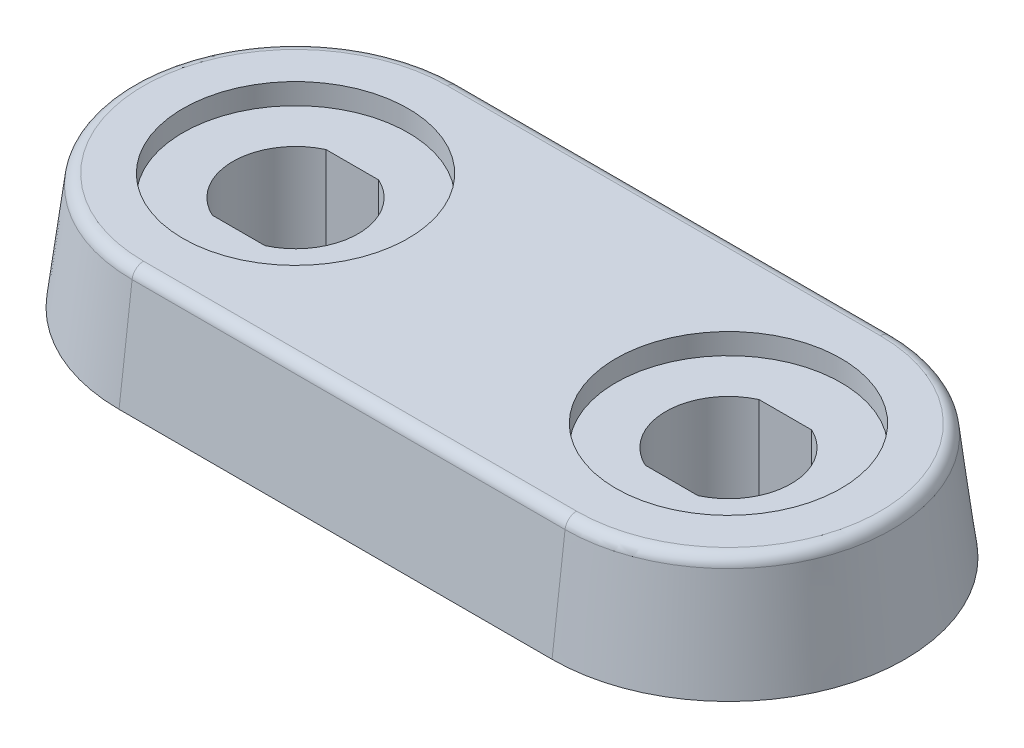
ISO-10303-21;
HEADER;
FILE_DESCRIPTION(('STEP AP214'),'2;1');
FILE_NAME('part.step','',(''),(''),'','','');
FILE_SCHEMA(('AUTOMOTIVE_DESIGN { 1 0 10303 214 1 1 1 1 }'));
ENDSEC;
DATA;
#1=APPLICATION_CONTEXT('core data for automotive mechanical design processes');
#2=APPLICATION_PROTOCOL_DEFINITION('international standard','automotive_design',2000,#1);
#3=PRODUCT_CONTEXT('',#1,'mechanical');
#4=PRODUCT('Part','Part','',(#3));
#5=PRODUCT_RELATED_PRODUCT_CATEGORY('part','',(#4));
#6=PRODUCT_DEFINITION_FORMATION('','',#4);
#7=PRODUCT_DEFINITION_CONTEXT('part definition',#1,'design');
#8=PRODUCT_DEFINITION('design','',#6,#7);
#9=PRODUCT_DEFINITION_SHAPE('','',#8);
#10=(LENGTH_UNIT() NAMED_UNIT(*) SI_UNIT(.MILLI.,.METRE.));
#11=(NAMED_UNIT(*) PLANE_ANGLE_UNIT() SI_UNIT($,.RADIAN.));
#12=(NAMED_UNIT(*) SI_UNIT($,.STERADIAN.) SOLID_ANGLE_UNIT());
#13=UNCERTAINTY_MEASURE_WITH_UNIT(LENGTH_MEASURE(1.E-05),#10,'distance_accuracy_value','');
#14=(GEOMETRIC_REPRESENTATION_CONTEXT(3) GLOBAL_UNCERTAINTY_ASSIGNED_CONTEXT((#13)) GLOBAL_UNIT_ASSIGNED_CONTEXT((#10,
#11,#12)) REPRESENTATION_CONTEXT('',''));
#15=CARTESIAN_POINT('',(0.,0.,0.));
#16=DIRECTION('',(0.,0.,1.));
#17=DIRECTION('',(1.,0.,0.));
#18=AXIS2_PLACEMENT_3D('',#15,#16,#17);
#19=CARTESIAN_POINT('',(0.,3.75,2.8));
#20=DIRECTION('',(0.,-1.,0.));
#21=DIRECTION('',(0.,0.,-1.));
#22=AXIS2_PLACEMENT_3D('',#19,#20,#21);
#23=PLANE('',#22);
#24=CARTESIAN_POINT('',(0.,3.75,-2.8));
#25=DIRECTION('',(0.,-1.,0.));
#26=DIRECTION('',(0.,0.,-1.));
#27=AXIS2_PLACEMENT_3D('',#24,#25,#26);
#28=CIRCLE('',#27,2.15);
#29=CARTESIAN_POINT('',(-2.15,3.75,-2.8));
#30=VERTEX_POINT('',#29);
#31=CARTESIAN_POINT('',(2.15,3.75,-2.8));
#32=VERTEX_POINT('',#31);
#33=EDGE_CURVE('E163',#30,#32,#28,.T.);
#34=ORIENTED_EDGE('',*,*,#33,.T.);
#35=DIRECTION('',(0.,0.,-1.));
#36=VECTOR('',#35,1.);
#37=CARTESIAN_POINT('',(2.15,3.75,2.8));
#38=LINE('',#37,#36);
#39=CARTESIAN_POINT('',(2.15,3.75,2.8));
#40=VERTEX_POINT('',#39);
#41=EDGE_CURVE('E151',#32,#40,#38,.F.);
#42=ORIENTED_EDGE('',*,*,#41,.T.);
#43=CARTESIAN_POINT('',(0.,3.75,2.8));
#44=DIRECTION('',(0.,-1.,0.));
#45=DIRECTION('',(0.,0.,-1.));
#46=AXIS2_PLACEMENT_3D('',#43,#44,#45);
#47=CIRCLE('',#46,2.15);
#48=CARTESIAN_POINT('',(-2.15,3.75,2.8));
#49=VERTEX_POINT('',#48);
#50=EDGE_CURVE('E140',#40,#49,#47,.T.);
#51=ORIENTED_EDGE('',*,*,#50,.T.);
#52=DIRECTION('',(0.,0.,1.));
#53=VECTOR('',#52,1.);
#54=CARTESIAN_POINT('',(-2.15,3.75,2.8));
#55=LINE('',#54,#53);
#56=EDGE_CURVE('E166',#49,#30,#55,.F.);
#57=ORIENTED_EDGE('',*,*,#56,.T.);
#58=EDGE_LOOP('',(#34,#42,#51,#57));
#59=FACE_BOUND('',#58,.T.);
#60=ADVANCED_FACE('F16',(#59),#23,.T.);
#61=CARTESIAN_POINT('',(-9.325,-0.3,0.));
#62=DIRECTION('',(0.,-1.,0.));
#63=DIRECTION('',(0.,0.,-1.));
#64=AXIS2_PLACEMENT_3D('',#61,#62,#63);
#65=PLANE('',#64);
#66=CARTESIAN_POINT('',(-9.325,-0.3,0.));
#67=DIRECTION('',(0.,1.,0.));
#68=DIRECTION('',(0.,0.,1.));
#69=AXIS2_PLACEMENT_3D('',#66,#67,#68);
#70=CIRCLE('',#69,3.415);
#71=CARTESIAN_POINT('',(-9.325,-0.3,3.415));
#72=VERTEX_POINT('',#71);
#73=EDGE_CURVE('E152',#72,#72,#70,.T.);
#74=ORIENTED_EDGE('',*,*,#73,.T.);
#75=EDGE_LOOP('',(#74));
#76=FACE_BOUND('',#75,.T.);
#77=CARTESIAN_POINT('',(-9.325,-0.3,0.));
#78=DIRECTION('',(0.,1.,0.));
#79=DIRECTION('',(0.,0.,1.));
#80=AXIS2_PLACEMENT_3D('',#77,#78,#79);
#81=CIRCLE('',#80,5.8);
#82=CARTESIAN_POINT('',(-9.325,-0.3,5.8));
#83=VERTEX_POINT('',#82);
#84=EDGE_CURVE('E237',#83,#83,#81,.T.);
#85=ORIENTED_EDGE('',*,*,#84,.F.);
#86=EDGE_LOOP('',(#85));
#87=FACE_BOUND('',#86,.T.);
#88=ADVANCED_FACE('F262',(#76,#87),#65,.T.);
#89=CARTESIAN_POINT('',(9.325,-0.3,0.));
#90=DIRECTION('',(0.,-1.,0.));
#91=DIRECTION('',(0.,0.,-1.));
#92=AXIS2_PLACEMENT_3D('',#89,#90,#91);
#93=PLANE('',#92);
#94=CARTESIAN_POINT('',(9.325,-0.3,0.));
#95=DIRECTION('',(0.,1.,0.));
#96=DIRECTION('',(0.,0.,1.));
#97=AXIS2_PLACEMENT_3D('',#94,#95,#96);
#98=CIRCLE('',#97,3.415);
#99=CARTESIAN_POINT('',(9.325,-0.3,3.415));
#100=VERTEX_POINT('',#99);
#101=EDGE_CURVE('E19',#100,#100,#98,.T.);
#102=ORIENTED_EDGE('',*,*,#101,.T.);
#103=EDGE_LOOP('',(#102));
#104=FACE_BOUND('',#103,.T.);
#105=CARTESIAN_POINT('',(9.325,-0.3,0.));
#106=DIRECTION('',(0.,1.,0.));
#107=DIRECTION('',(0.,0.,1.));
#108=AXIS2_PLACEMENT_3D('',#105,#106,#107);
#109=CIRCLE('',#108,5.8);
#110=CARTESIAN_POINT('',(9.325,-0.3,5.8));
#111=VERTEX_POINT('',#110);
#112=EDGE_CURVE('E234',#111,#111,#109,.T.);
#113=ORIENTED_EDGE('',*,*,#112,.F.);
#114=EDGE_LOOP('',(#113));
#115=FACE_BOUND('',#114,.T.);
#116=ADVANCED_FACE('F247',(#104,#115),#93,.T.);
#117=CARTESIAN_POINT('',(9.325,-0.3,0.));
#118=DIRECTION('',(0.,1.,0.));
#119=DIRECTION('',(0.,0.,1.));
#120=AXIS2_PLACEMENT_3D('',#117,#118,#119);
#121=CYLINDRICAL_SURFACE('',#120,3.415);
#122=CARTESIAN_POINT('',(9.325,0.,0.));
#123=DIRECTION('',(0.,1.,0.));
#124=DIRECTION('',(0.,0.,1.));
#125=AXIS2_PLACEMENT_3D('',#122,#123,#124);
#126=CIRCLE('',#125,3.415);
#127=CARTESIAN_POINT('',(9.325,0.,3.415));
#128=VERTEX_POINT('',#127);
#129=EDGE_CURVE('E231',#128,#128,#126,.F.);
#130=ORIENTED_EDGE('',*,*,#129,.F.);
#131=EDGE_LOOP('',(#130));
#132=FACE_BOUND('',#131,.T.);
#133=ORIENTED_EDGE('',*,*,#101,.F.);
#134=EDGE_LOOP('',(#133));
#135=FACE_BOUND('',#134,.T.);
#136=ADVANCED_FACE('F250',(#132,#135),#121,.F.);
#137=CARTESIAN_POINT('',(-9.325,-0.3,0.));
#138=DIRECTION('',(0.,1.,0.));
#139=DIRECTION('',(0.,0.,1.));
#140=AXIS2_PLACEMENT_3D('',#137,#138,#139);
#141=CYLINDRICAL_SURFACE('',#140,3.415);
#142=CARTESIAN_POINT('',(-9.325,0.,0.));
#143=DIRECTION('',(0.,1.,0.));
#144=DIRECTION('',(0.,0.,1.));
#145=AXIS2_PLACEMENT_3D('',#142,#143,#144);
#146=CIRCLE('',#145,3.415);
#147=CARTESIAN_POINT('',(-9.325,0.,3.415));
#148=VERTEX_POINT('',#147);
#149=EDGE_CURVE('E228',#148,#148,#146,.F.);
#150=ORIENTED_EDGE('',*,*,#149,.F.);
#151=EDGE_LOOP('',(#150));
#152=FACE_BOUND('',#151,.T.);
#153=ORIENTED_EDGE('',*,*,#73,.F.);
#154=EDGE_LOOP('',(#153));
#155=FACE_BOUND('',#154,.T.);
#156=ADVANCED_FACE('F252',(#152,#155),#141,.F.);
#157=CARTESIAN_POINT('',(0.,3.75,2.8));
#158=DIRECTION('',(0.,-1.,0.));
#159=DIRECTION('',(0.,0.,-1.));
#160=AXIS2_PLACEMENT_3D('',#157,#158,#159);
#161=CYLINDRICAL_SURFACE('',#160,2.15);
#162=DIRECTION('',(0.,1.,0.));
#163=VECTOR('',#162,1.);
#164=CARTESIAN_POINT('',(-2.15,3.75,2.8));
#165=LINE('',#164,#163);
#166=CARTESIAN_POINT('',(-2.15,0.,2.8));
#167=VERTEX_POINT('',#166);
#168=EDGE_CURVE('E146',#167,#49,#165,.T.);
#169=ORIENTED_EDGE('',*,*,#168,.T.);
#170=ORIENTED_EDGE('',*,*,#50,.F.);
#171=DIRECTION('',(0.,1.,0.));
#172=VECTOR('',#171,1.);
#173=CARTESIAN_POINT('',(2.15,3.75,2.8));
#174=LINE('',#173,#172);
#175=CARTESIAN_POINT('',(2.15,0.,2.8));
#176=VERTEX_POINT('',#175);
#177=EDGE_CURVE('E144',#40,#176,#174,.F.);
#178=ORIENTED_EDGE('',*,*,#177,.T.);
#179=CARTESIAN_POINT('',(0.,0.,2.8));
#180=DIRECTION('',(0.,-1.,0.));
#181=DIRECTION('',(0.,0.,-1.));
#182=AXIS2_PLACEMENT_3D('',#179,#180,#181);
#183=CIRCLE('',#182,2.15);
#184=EDGE_CURVE('E226',#167,#176,#183,.F.);
#185=ORIENTED_EDGE('',*,*,#184,.F.);
#186=EDGE_LOOP('',(#169,#170,#178,#185));
#187=FACE_BOUND('',#186,.T.);
#188=ADVANCED_FACE('F142',(#187),#161,.F.);
#189=CARTESIAN_POINT('',(2.15,3.75,2.8));
#190=DIRECTION('',(1.,0.,0.));
#191=DIRECTION('',(0.,0.,-1.));
#192=AXIS2_PLACEMENT_3D('',#189,#190,#191);
#193=PLANE('',#192);
#194=ORIENTED_EDGE('',*,*,#177,.F.);
#195=ORIENTED_EDGE('',*,*,#41,.F.);
#196=DIRECTION('',(0.,-1.,0.));
#197=VECTOR('',#196,1.);
#198=CARTESIAN_POINT('',(2.15,3.75,-2.8));
#199=LINE('',#198,#197);
#200=CARTESIAN_POINT('',(2.15,0.,-2.8));
#201=VERTEX_POINT('',#200);
#202=EDGE_CURVE('E161',#32,#201,#199,.T.);
#203=ORIENTED_EDGE('',*,*,#202,.T.);
#204=DIRECTION('',(0.,0.,-1.));
#205=VECTOR('',#204,1.);
#206=CARTESIAN_POINT('',(2.15,0.,0.));
#207=LINE('',#206,#205);
#208=EDGE_CURVE('E160',#176,#201,#207,.T.);
#209=ORIENTED_EDGE('',*,*,#208,.F.);
#210=EDGE_LOOP('',(#194,#195,#203,#209));
#211=FACE_BOUND('',#210,.T.);
#212=ADVANCED_FACE('F156',(#211),#193,.F.);
#213=CARTESIAN_POINT('',(0.,3.75,-2.8));
#214=DIRECTION('',(0.,-1.,0.));
#215=DIRECTION('',(0.,0.,-1.));
#216=AXIS2_PLACEMENT_3D('',#213,#214,#215);
#217=CYLINDRICAL_SURFACE('',#216,2.15);
#218=ORIENTED_EDGE('',*,*,#33,.F.);
#219=DIRECTION('',(0.,1.,0.));
#220=VECTOR('',#219,1.);
#221=CARTESIAN_POINT('',(-2.15,3.75,-2.8));
#222=LINE('',#221,#220);
#223=CARTESIAN_POINT('',(-2.15,0.,-2.8));
#224=VERTEX_POINT('',#223);
#225=EDGE_CURVE('E240',#30,#224,#222,.F.);
#226=ORIENTED_EDGE('',*,*,#225,.T.);
#227=CARTESIAN_POINT('',(0.,0.,-2.8));
#228=DIRECTION('',(0.,-1.,0.));
#229=DIRECTION('',(0.,0.,-1.));
#230=AXIS2_PLACEMENT_3D('',#227,#228,#229);
#231=CIRCLE('',#230,2.15);
#232=EDGE_CURVE('E224',#201,#224,#231,.F.);
#233=ORIENTED_EDGE('',*,*,#232,.F.);
#234=ORIENTED_EDGE('',*,*,#202,.F.);
#235=EDGE_LOOP('',(#218,#226,#233,#234));
#236=FACE_BOUND('',#235,.T.);
#237=ADVANCED_FACE('F424',(#236),#217,.F.);
#238=CARTESIAN_POINT('',(-2.15,3.75,2.8));
#239=DIRECTION('',(-1.,0.,0.));
#240=DIRECTION('',(0.,0.,1.));
#241=AXIS2_PLACEMENT_3D('',#238,#239,#240);
#242=PLANE('',#241);
#243=ORIENTED_EDGE('',*,*,#225,.F.);
#244=ORIENTED_EDGE('',*,*,#56,.F.);
#245=ORIENTED_EDGE('',*,*,#168,.F.);
#246=DIRECTION('',(0.,0.,-1.));
#247=VECTOR('',#246,1.);
#248=CARTESIAN_POINT('',(-2.15,0.,0.));
#249=LINE('',#248,#247);
#250=EDGE_CURVE('E223',#224,#167,#249,.F.);
#251=ORIENTED_EDGE('',*,*,#250,.F.);
#252=EDGE_LOOP('',(#243,#244,#245,#251));
#253=FACE_BOUND('',#252,.T.);
#254=ADVANCED_FACE('F430',(#253),#242,.F.);
#255=CARTESIAN_POINT('',(-9.325,-0.3,0.));
#256=DIRECTION('',(0.,1.,0.));
#257=DIRECTION('',(0.,0.,1.));
#258=AXIS2_PLACEMENT_3D('',#255,#256,#257);
#259=CYLINDRICAL_SURFACE('',#258,5.8);
#260=CARTESIAN_POINT('',(-9.325,0.,0.));
#261=DIRECTION('',(0.,1.,0.));
#262=DIRECTION('',(0.,0.,1.));
#263=AXIS2_PLACEMENT_3D('',#260,#261,#262);
#264=CIRCLE('',#263,5.8);
#265=CARTESIAN_POINT('',(-9.325,0.,5.8));
#266=VERTEX_POINT('',#265);
#267=EDGE_CURVE('E220',#266,#266,#264,.T.);
#268=ORIENTED_EDGE('',*,*,#267,.F.);
#269=EDGE_LOOP('',(#268));
#270=FACE_BOUND('',#269,.T.);
#271=ORIENTED_EDGE('',*,*,#84,.T.);
#272=EDGE_LOOP('',(#271));
#273=FACE_BOUND('',#272,.T.);
#274=ADVANCED_FACE('F432',(#270,#273),#259,.T.);
#275=CARTESIAN_POINT('',(9.325,-0.3,0.));
#276=DIRECTION('',(0.,1.,0.));
#277=DIRECTION('',(0.,0.,1.));
#278=AXIS2_PLACEMENT_3D('',#275,#276,#277);
#279=CYLINDRICAL_SURFACE('',#278,5.8);
#280=CARTESIAN_POINT('',(9.325,0.,0.));
#281=DIRECTION('',(0.,1.,0.));
#282=DIRECTION('',(0.,0.,1.));
#283=AXIS2_PLACEMENT_3D('',#280,#281,#282);
#284=CIRCLE('',#283,5.8);
#285=CARTESIAN_POINT('',(9.325,0.,5.8));
#286=VERTEX_POINT('',#285);
#287=EDGE_CURVE('E217',#286,#286,#284,.T.);
#288=ORIENTED_EDGE('',*,*,#287,.F.);
#289=EDGE_LOOP('',(#288));
#290=FACE_BOUND('',#289,.T.);
#291=ORIENTED_EDGE('',*,*,#112,.T.);
#292=EDGE_LOOP('',(#291));
#293=FACE_BOUND('',#292,.T.);
#294=ADVANCED_FACE('F438',(#290,#293),#279,.T.);
#295=CARTESIAN_POINT('',(9.325,0.,0.));
#296=DIRECTION('',(0.,-1.,0.));
#297=DIRECTION('',(0.,0.,-1.));
#298=AXIS2_PLACEMENT_3D('',#295,#296,#297);
#299=PLANE('',#298);
#300=CARTESIAN_POINT('',(9.325,0.,0.));
#301=DIRECTION('',(0.,1.,0.));
#302=DIRECTION('',(0.,0.,1.));
#303=AXIS2_PLACEMENT_3D('',#300,#301,#302);
#304=CIRCLE('',#303,2.7);
#305=CARTESIAN_POINT('',(10.459680571791,0.,2.45));
#306=VERTEX_POINT('',#305);
#307=CARTESIAN_POINT('',(10.459680571791,0.,-2.45));
#308=VERTEX_POINT('',#307);
#309=EDGE_CURVE('E209',#306,#308,#304,.T.);
#310=ORIENTED_EDGE('',*,*,#309,.T.);
#311=DIRECTION('',(-1.,0.,0.));
#312=VECTOR('',#311,1.);
#313=CARTESIAN_POINT('',(8.19031942820897,0.,-2.45));
#314=LINE('',#313,#312);
#315=CARTESIAN_POINT('',(8.19031942820898,0.,-2.45));
#316=VERTEX_POINT('',#315);
#317=EDGE_CURVE('E216',#308,#316,#314,.T.);
#318=ORIENTED_EDGE('',*,*,#317,.T.);
#319=CARTESIAN_POINT('',(9.325,0.,0.));
#320=DIRECTION('',(0.,1.,0.));
#321=DIRECTION('',(0.,0.,1.));
#322=AXIS2_PLACEMENT_3D('',#319,#320,#321);
#323=CIRCLE('',#322,2.7);
#324=CARTESIAN_POINT('',(8.19031942820897,0.,2.45));
#325=VERTEX_POINT('',#324);
#326=EDGE_CURVE('E214',#316,#325,#323,.T.);
#327=ORIENTED_EDGE('',*,*,#326,.T.);
#328=DIRECTION('',(1.,0.,0.));
#329=VECTOR('',#328,1.);
#330=CARTESIAN_POINT('',(10.459680571791,0.,2.45));
#331=LINE('',#330,#329);
#332=EDGE_CURVE('E397',#325,#306,#331,.T.);
#333=ORIENTED_EDGE('',*,*,#332,.T.);
#334=EDGE_LOOP('',(#310,#318,#327,#333));
#335=FACE_BOUND('',#334,.T.);
#336=ORIENTED_EDGE('',*,*,#129,.T.);
#337=EDGE_LOOP('',(#336));
#338=FACE_BOUND('',#337,.T.);
#339=ADVANCED_FACE('F483',(#335,#338),#299,.T.);
#340=CARTESIAN_POINT('',(9.325,0.,0.));
#341=DIRECTION('',(0.,-1.,0.));
#342=DIRECTION('',(0.,0.,-1.));
#343=AXIS2_PLACEMENT_3D('',#340,#341,#342);
#344=PLANE('',#343);
#345=CARTESIAN_POINT('',(-9.325,0.,0.));
#346=DIRECTION('',(0.,1.,0.));
#347=DIRECTION('',(0.,0.,1.));
#348=AXIS2_PLACEMENT_3D('',#345,#346,#347);
#349=CIRCLE('',#348,2.7);
#350=CARTESIAN_POINT('',(-10.459680571791,0.,-2.45));
#351=VERTEX_POINT('',#350);
#352=CARTESIAN_POINT('',(-10.459680571791,0.,2.45));
#353=VERTEX_POINT('',#352);
#354=EDGE_CURVE('E200',#351,#353,#349,.T.);
#355=ORIENTED_EDGE('',*,*,#354,.T.);
#356=DIRECTION('',(1.,0.,0.));
#357=VECTOR('',#356,1.);
#358=CARTESIAN_POINT('',(-10.459680571791,0.,2.45));
#359=LINE('',#358,#357);
#360=CARTESIAN_POINT('',(-8.19031942820897,0.,2.45));
#361=VERTEX_POINT('',#360);
#362=EDGE_CURVE('E207',#353,#361,#359,.T.);
#363=ORIENTED_EDGE('',*,*,#362,.T.);
#364=CARTESIAN_POINT('',(-9.325,0.,0.));
#365=DIRECTION('',(0.,1.,0.));
#366=DIRECTION('',(0.,0.,1.));
#367=AXIS2_PLACEMENT_3D('',#364,#365,#366);
#368=CIRCLE('',#367,2.7);
#369=CARTESIAN_POINT('',(-8.19031942820898,0.,-2.45));
#370=VERTEX_POINT('',#369);
#371=EDGE_CURVE('E205',#361,#370,#368,.T.);
#372=ORIENTED_EDGE('',*,*,#371,.T.);
#373=DIRECTION('',(-1.,0.,0.));
#374=VECTOR('',#373,1.);
#375=CARTESIAN_POINT('',(-8.19031942820897,0.,-2.45));
#376=LINE('',#375,#374);
#377=EDGE_CURVE('E387',#370,#351,#376,.T.);
#378=ORIENTED_EDGE('',*,*,#377,.T.);
#379=EDGE_LOOP('',(#355,#363,#372,#378));
#380=FACE_BOUND('',#379,.T.);
#381=ORIENTED_EDGE('',*,*,#149,.T.);
#382=EDGE_LOOP('',(#381));
#383=FACE_BOUND('',#382,.T.);
#384=ADVANCED_FACE('F492',(#380,#383),#344,.T.);
#385=CARTESIAN_POINT('',(9.325,0.,0.));
#386=DIRECTION('',(0.,-1.,0.));
#387=DIRECTION('',(0.,0.,-1.));
#388=AXIS2_PLACEMENT_3D('',#385,#386,#387);
#389=PLANE('',#388);
#390=ORIENTED_EDGE('',*,*,#287,.T.);
#391=EDGE_LOOP('',(#390));
#392=FACE_BOUND('',#391,.T.);
#393=ORIENTED_EDGE('',*,*,#267,.T.);
#394=EDGE_LOOP('',(#393));
#395=FACE_BOUND('',#394,.T.);
#396=CARTESIAN_POINT('',(-9.325,0.,0.));
#397=DIRECTION('',(0.,-1.,0.));
#398=DIRECTION('',(1.,0.,0.));
#399=AXIS2_PLACEMENT_3D('',#396,#397,#398);
#400=CIRCLE('',#399,7.6);
#401=CARTESIAN_POINT('',(-9.325,0.,-7.6));
#402=VERTEX_POINT('',#401);
#403=CARTESIAN_POINT('',(-9.325,0.,7.6));
#404=VERTEX_POINT('',#403);
#405=EDGE_CURVE('E196',#402,#404,#400,.F.);
#406=ORIENTED_EDGE('',*,*,#405,.F.);
#407=DIRECTION('',(1.,0.,0.));
#408=VECTOR('',#407,1.);
#409=CARTESIAN_POINT('',(-9.325,0.,-7.6));
#410=LINE('',#409,#408);
#411=CARTESIAN_POINT('',(9.325,0.,-7.6));
#412=VERTEX_POINT('',#411);
#413=EDGE_CURVE('E383',#412,#402,#410,.F.);
#414=ORIENTED_EDGE('',*,*,#413,.F.);
#415=CARTESIAN_POINT('',(9.325,0.,0.));
#416=DIRECTION('',(0.,-1.,0.));
#417=DIRECTION('',(1.,0.,0.));
#418=AXIS2_PLACEMENT_3D('',#415,#416,#417);
#419=CIRCLE('',#418,7.6);
#420=CARTESIAN_POINT('',(9.325,0.,7.6));
#421=VERTEX_POINT('',#420);
#422=EDGE_CURVE('E191',#421,#412,#419,.F.);
#423=ORIENTED_EDGE('',*,*,#422,.F.);
#424=DIRECTION('',(1.,0.,0.));
#425=VECTOR('',#424,1.);
#426=CARTESIAN_POINT('',(-9.325,0.,7.6));
#427=LINE('',#426,#425);
#428=EDGE_CURVE('E190',#404,#421,#427,.T.);
#429=ORIENTED_EDGE('',*,*,#428,.F.);
#430=EDGE_LOOP('',(#406,#414,#423,#429));
#431=FACE_BOUND('',#430,.T.);
#432=ORIENTED_EDGE('',*,*,#232,.T.);
#433=ORIENTED_EDGE('',*,*,#250,.T.);
#434=ORIENTED_EDGE('',*,*,#184,.T.);
#435=ORIENTED_EDGE('',*,*,#208,.T.);
#436=EDGE_LOOP('',(#432,#433,#434,#435));
#437=FACE_BOUND('',#436,.T.);
#438=ADVANCED_FACE('F428',(#392,#395,#431,#437),#389,.T.);
#439=CARTESIAN_POINT('',(9.325,0.,0.));
#440=DIRECTION('',(0.,1.,0.));
#441=DIRECTION('',(0.,0.,1.));
#442=AXIS2_PLACEMENT_3D('',#439,#440,#441);
#443=CYLINDRICAL_SURFACE('',#442,2.7);
#444=DIRECTION('',(0.,1.,0.));
#445=VECTOR('',#444,1.);
#446=CARTESIAN_POINT('',(8.19031942820897,0.,2.45));
#447=LINE('',#446,#445);
#448=CARTESIAN_POINT('',(8.19031942820897,4.1,2.45));
#449=VERTEX_POINT('',#448);
#450=EDGE_CURVE('E398',#449,#325,#447,.F.);
#451=ORIENTED_EDGE('',*,*,#450,.T.);
#452=ORIENTED_EDGE('',*,*,#326,.F.);
#453=DIRECTION('',(0.,1.,0.));
#454=VECTOR('',#453,1.);
#455=CARTESIAN_POINT('',(8.19031942820897,0.,-2.45));
#456=LINE('',#455,#454);
#457=CARTESIAN_POINT('',(8.19031942820898,4.1,-2.45));
#458=VERTEX_POINT('',#457);
#459=EDGE_CURVE('E213',#316,#458,#456,.T.);
#460=ORIENTED_EDGE('',*,*,#459,.T.);
#461=CARTESIAN_POINT('',(9.325,4.1,0.));
#462=DIRECTION('',(0.,1.,0.));
#463=DIRECTION('',(0.,0.,1.));
#464=AXIS2_PLACEMENT_3D('',#461,#462,#463);
#465=CIRCLE('',#464,2.7);
#466=EDGE_CURVE('E188',#449,#458,#465,.F.);
#467=ORIENTED_EDGE('',*,*,#466,.F.);
#468=EDGE_LOOP('',(#451,#452,#460,#467));
#469=FACE_BOUND('',#468,.T.);
#470=ADVANCED_FACE('F511',(#469),#443,.F.);
#471=CARTESIAN_POINT('',(8.19031942820897,0.,-2.45));
#472=DIRECTION('',(0.,0.,-1.));
#473=DIRECTION('',(-1.,0.,0.));
#474=AXIS2_PLACEMENT_3D('',#471,#472,#473);
#475=PLANE('',#474);
#476=ORIENTED_EDGE('',*,*,#459,.F.);
#477=ORIENTED_EDGE('',*,*,#317,.F.);
#478=DIRECTION('',(0.,1.,0.));
#479=VECTOR('',#478,1.);
#480=CARTESIAN_POINT('',(10.459680571791,0.,-2.45));
#481=LINE('',#480,#479);
#482=CARTESIAN_POINT('',(10.459680571791,4.1,-2.45));
#483=VERTEX_POINT('',#482);
#484=EDGE_CURVE('E212',#308,#483,#481,.T.);
#485=ORIENTED_EDGE('',*,*,#484,.T.);
#486=DIRECTION('',(1.,0.,0.));
#487=VECTOR('',#486,1.);
#488=CARTESIAN_POINT('',(9.325,4.1,-2.45));
#489=LINE('',#488,#487);
#490=EDGE_CURVE('E187',#458,#483,#489,.T.);
#491=ORIENTED_EDGE('',*,*,#490,.F.);
#492=EDGE_LOOP('',(#476,#477,#485,#491));
#493=FACE_BOUND('',#492,.T.);
#494=ADVANCED_FACE('F521',(#493),#475,.F.);
#495=CARTESIAN_POINT('',(9.325,0.,0.));
#496=DIRECTION('',(0.,1.,0.));
#497=DIRECTION('',(0.,0.,1.));
#498=AXIS2_PLACEMENT_3D('',#495,#496,#497);
#499=CYLINDRICAL_SURFACE('',#498,2.7);
#500=ORIENTED_EDGE('',*,*,#484,.F.);
#501=ORIENTED_EDGE('',*,*,#309,.F.);
#502=DIRECTION('',(0.,1.,0.));
#503=VECTOR('',#502,1.);
#504=CARTESIAN_POINT('',(10.459680571791,0.,2.45));
#505=LINE('',#504,#503);
#506=CARTESIAN_POINT('',(10.459680571791,4.1,2.45));
#507=VERTEX_POINT('',#506);
#508=EDGE_CURVE('E208',#306,#507,#505,.T.);
#509=ORIENTED_EDGE('',*,*,#508,.T.);
#510=CARTESIAN_POINT('',(9.325,4.1,0.));
#511=DIRECTION('',(0.,1.,0.));
#512=DIRECTION('',(0.,0.,1.));
#513=AXIS2_PLACEMENT_3D('',#510,#511,#512);
#514=CIRCLE('',#513,2.7);
#515=EDGE_CURVE('E185',#483,#507,#514,.F.);
#516=ORIENTED_EDGE('',*,*,#515,.F.);
#517=EDGE_LOOP('',(#500,#501,#509,#516));
#518=FACE_BOUND('',#517,.T.);
#519=ADVANCED_FACE('F531',(#518),#499,.F.);
#520=CARTESIAN_POINT('',(10.459680571791,0.,2.45));
#521=DIRECTION('',(0.,0.,1.));
#522=DIRECTION('',(1.,0.,0.));
#523=AXIS2_PLACEMENT_3D('',#520,#521,#522);
#524=PLANE('',#523);
#525=ORIENTED_EDGE('',*,*,#508,.F.);
#526=ORIENTED_EDGE('',*,*,#332,.F.);
#527=ORIENTED_EDGE('',*,*,#450,.F.);
#528=DIRECTION('',(1.,0.,0.));
#529=VECTOR('',#528,1.);
#530=CARTESIAN_POINT('',(9.325,4.1,2.45));
#531=LINE('',#530,#529);
#532=EDGE_CURVE('E184',#507,#449,#531,.F.);
#533=ORIENTED_EDGE('',*,*,#532,.F.);
#534=EDGE_LOOP('',(#525,#526,#527,#533));
#535=FACE_BOUND('',#534,.T.);
#536=ADVANCED_FACE('F541',(#535),#524,.F.);
#537=CARTESIAN_POINT('',(-9.325,0.,0.));
#538=DIRECTION('',(0.,1.,0.));
#539=DIRECTION('',(0.,0.,1.));
#540=AXIS2_PLACEMENT_3D('',#537,#538,#539);
#541=CYLINDRICAL_SURFACE('',#540,2.7);
#542=DIRECTION('',(0.,1.,0.));
#543=VECTOR('',#542,1.);
#544=CARTESIAN_POINT('',(-8.19031942820897,0.,-2.45));
#545=LINE('',#544,#543);
#546=CARTESIAN_POINT('',(-8.19031942820898,4.1,-2.45));
#547=VERTEX_POINT('',#546);
#548=EDGE_CURVE('E388',#547,#370,#545,.F.);
#549=ORIENTED_EDGE('',*,*,#548,.T.);
#550=ORIENTED_EDGE('',*,*,#371,.F.);
#551=DIRECTION('',(0.,1.,0.));
#552=VECTOR('',#551,1.);
#553=CARTESIAN_POINT('',(-8.19031942820897,0.,2.45));
#554=LINE('',#553,#552);
#555=CARTESIAN_POINT('',(-8.19031942820897,4.1,2.45));
#556=VERTEX_POINT('',#555);
#557=EDGE_CURVE('E204',#361,#556,#554,.T.);
#558=ORIENTED_EDGE('',*,*,#557,.T.);
#559=CARTESIAN_POINT('',(-9.325,4.1,0.));
#560=DIRECTION('',(0.,1.,0.));
#561=DIRECTION('',(0.,0.,1.));
#562=AXIS2_PLACEMENT_3D('',#559,#560,#561);
#563=CIRCLE('',#562,2.7);
#564=EDGE_CURVE('E182',#547,#556,#563,.F.);
#565=ORIENTED_EDGE('',*,*,#564,.F.);
#566=EDGE_LOOP('',(#549,#550,#558,#565));
#567=FACE_BOUND('',#566,.T.);
#568=ADVANCED_FACE('F551',(#567),#541,.F.);
#569=CARTESIAN_POINT('',(-10.459680571791,0.,2.45));
#570=DIRECTION('',(0.,0.,1.));
#571=DIRECTION('',(1.,0.,0.));
#572=AXIS2_PLACEMENT_3D('',#569,#570,#571);
#573=PLANE('',#572);
#574=ORIENTED_EDGE('',*,*,#557,.F.);
#575=ORIENTED_EDGE('',*,*,#362,.F.);
#576=DIRECTION('',(0.,1.,0.));
#577=VECTOR('',#576,1.);
#578=CARTESIAN_POINT('',(-10.459680571791,0.,2.45));
#579=LINE('',#578,#577);
#580=CARTESIAN_POINT('',(-10.459680571791,4.1,2.45));
#581=VERTEX_POINT('',#580);
#582=EDGE_CURVE('E203',#353,#581,#579,.T.);
#583=ORIENTED_EDGE('',*,*,#582,.T.);
#584=DIRECTION('',(1.,0.,0.));
#585=VECTOR('',#584,1.);
#586=CARTESIAN_POINT('',(-9.325,4.1,2.45));
#587=LINE('',#586,#585);
#588=EDGE_CURVE('E181',#556,#581,#587,.F.);
#589=ORIENTED_EDGE('',*,*,#588,.F.);
#590=EDGE_LOOP('',(#574,#575,#583,#589));
#591=FACE_BOUND('',#590,.T.);
#592=ADVANCED_FACE('F561',(#591),#573,.F.);
#593=CARTESIAN_POINT('',(-9.325,0.,0.));
#594=DIRECTION('',(0.,1.,0.));
#595=DIRECTION('',(0.,0.,1.));
#596=AXIS2_PLACEMENT_3D('',#593,#594,#595);
#597=CYLINDRICAL_SURFACE('',#596,2.7);
#598=ORIENTED_EDGE('',*,*,#582,.F.);
#599=ORIENTED_EDGE('',*,*,#354,.F.);
#600=DIRECTION('',(0.,1.,0.));
#601=VECTOR('',#600,1.);
#602=CARTESIAN_POINT('',(-10.459680571791,0.,-2.45));
#603=LINE('',#602,#601);
#604=CARTESIAN_POINT('',(-10.459680571791,4.1,-2.45));
#605=VERTEX_POINT('',#604);
#606=EDGE_CURVE('E199',#351,#605,#603,.T.);
#607=ORIENTED_EDGE('',*,*,#606,.T.);
#608=CARTESIAN_POINT('',(-9.325,4.1,0.));
#609=DIRECTION('',(0.,1.,0.));
#610=DIRECTION('',(0.,0.,1.));
#611=AXIS2_PLACEMENT_3D('',#608,#609,#610);
#612=CIRCLE('',#611,2.7);
#613=EDGE_CURVE('E178',#581,#605,#612,.F.);
#614=ORIENTED_EDGE('',*,*,#613,.F.);
#615=EDGE_LOOP('',(#598,#599,#607,#614));
#616=FACE_BOUND('',#615,.T.);
#617=ADVANCED_FACE('F571',(#616),#597,.F.);
#618=CARTESIAN_POINT('',(-8.19031942820897,0.,-2.45));
#619=DIRECTION('',(0.,0.,-1.));
#620=DIRECTION('',(-1.,0.,0.));
#621=AXIS2_PLACEMENT_3D('',#618,#619,#620);
#622=PLANE('',#621);
#623=ORIENTED_EDGE('',*,*,#606,.F.);
#624=ORIENTED_EDGE('',*,*,#377,.F.);
#625=ORIENTED_EDGE('',*,*,#548,.F.);
#626=DIRECTION('',(1.,0.,0.));
#627=VECTOR('',#626,1.);
#628=CARTESIAN_POINT('',(-9.325,4.1,-2.45));
#629=LINE('',#628,#627);
#630=EDGE_CURVE('E180',#605,#547,#629,.T.);
#631=ORIENTED_EDGE('',*,*,#630,.F.);
#632=EDGE_LOOP('',(#623,#624,#625,#631));
#633=FACE_BOUND('',#632,.T.);
#634=ADVANCED_FACE('F581',(#633),#622,.F.);
#635=CARTESIAN_POINT('',(-9.325,0.,0.));
#636=DIRECTION('',(0.,-1.,0.));
#637=DIRECTION('',(1.,0.,0.));
#638=AXIS2_PLACEMENT_3D('',#635,#636,#637);
#639=CONICAL_SURFACE('',#638,7.6,0.122173047639603);
#640=DIRECTION('',(0.,0.992546151641322,0.121869343405148));
#641=VECTOR('',#640,1.);
#642=CARTESIAN_POINT('',(-9.325,0.,-7.6));
#643=LINE('',#642,#641);
#644=CARTESIAN_POINT('',(-9.325,4.56093467170257,-7.03998763902816));
#645=VERTEX_POINT('',#644);
#646=EDGE_CURVE('E198',#402,#645,#643,.T.);
#647=ORIENTED_EDGE('',*,*,#646,.F.);
#648=ORIENTED_EDGE('',*,*,#405,.T.);
#649=DIRECTION('',(0.,-0.992546151641322,0.121869343405148));
#650=VECTOR('',#649,1.);
#651=CARTESIAN_POINT('',(-9.325,0.,7.6));
#652=LINE('',#651,#650);
#653=CARTESIAN_POINT('',(-9.325,4.56093467170257,7.03998763902816));
#654=VERTEX_POINT('',#653);
#655=EDGE_CURVE('E376',#654,#404,#652,.T.);
#656=ORIENTED_EDGE('',*,*,#655,.F.);
#657=CARTESIAN_POINT('',(-9.325,4.56093467170257,0.));
#658=DIRECTION('',(0.,-1.,0.));
#659=DIRECTION('',(0.,0.,-1.));
#660=AXIS2_PLACEMENT_3D('',#657,#658,#659);
#661=CIRCLE('',#660,7.03998763902816);
#662=EDGE_CURVE('E344',#645,#654,#661,.F.);
#663=ORIENTED_EDGE('',*,*,#662,.F.);
#664=EDGE_LOOP('',(#647,#648,#656,#663));
#665=FACE_BOUND('',#664,.T.);
#666=ADVANCED_FACE('F591',(#665),#639,.T.);
#667=CARTESIAN_POINT('',(-9.325,0.,-7.6));
#668=DIRECTION('',(0.,0.121869343405148,-0.992546151641322));
#669=DIRECTION('',(0.,0.992546151641322,0.121869343405148));
#670=AXIS2_PLACEMENT_3D('',#667,#668,#669);
#671=PLANE('',#670);
#672=DIRECTION('',(0.,0.992546151641322,0.121869343405148));
#673=VECTOR('',#672,1.);
#674=CARTESIAN_POINT('',(9.325,0.,-7.6));
#675=LINE('',#674,#673);
#676=CARTESIAN_POINT('',(9.325,4.56093467170257,-7.03998763902816));
#677=VERTEX_POINT('',#676);
#678=EDGE_CURVE('E195',#412,#677,#675,.T.);
#679=ORIENTED_EDGE('',*,*,#678,.F.);
#680=ORIENTED_EDGE('',*,*,#413,.T.);
#681=ORIENTED_EDGE('',*,*,#646,.T.);
#682=DIRECTION('',(1.,0.,0.));
#683=VECTOR('',#682,1.);
#684=CARTESIAN_POINT('',(9.325,4.56093467170257,-7.03998763902816));
#685=LINE('',#684,#683);
#686=EDGE_CURVE('E343',#677,#645,#685,.F.);
#687=ORIENTED_EDGE('',*,*,#686,.F.);
#688=EDGE_LOOP('',(#679,#680,#681,#687));
#689=FACE_BOUND('',#688,.T.);
#690=ADVANCED_FACE('F601',(#689),#671,.T.);
#691=CARTESIAN_POINT('',(9.325,0.,0.));
#692=DIRECTION('',(0.,-1.,0.));
#693=DIRECTION('',(1.,0.,0.));
#694=AXIS2_PLACEMENT_3D('',#691,#692,#693);
#695=CONICAL_SURFACE('',#694,7.6,0.122173047639604);
#696=DIRECTION('',(0.,-0.992546151641322,0.121869343405148));
#697=VECTOR('',#696,1.);
#698=CARTESIAN_POINT('',(9.32500000000001,0.,7.6));
#699=LINE('',#698,#697);
#700=CARTESIAN_POINT('',(9.325,4.56093467170257,7.03998763902816));
#701=VERTEX_POINT('',#700);
#702=EDGE_CURVE('E194',#421,#701,#699,.F.);
#703=ORIENTED_EDGE('',*,*,#702,.F.);
#704=ORIENTED_EDGE('',*,*,#422,.T.);
#705=ORIENTED_EDGE('',*,*,#678,.T.);
#706=CARTESIAN_POINT('',(9.325,4.56093467170257,0.));
#707=DIRECTION('',(0.,-1.,0.));
#708=DIRECTION('',(0.,0.,-1.));
#709=AXIS2_PLACEMENT_3D('',#706,#707,#708);
#710=CIRCLE('',#709,7.03998763902816);
#711=EDGE_CURVE('E338',#701,#677,#710,.F.);
#712=ORIENTED_EDGE('',*,*,#711,.F.);
#713=EDGE_LOOP('',(#703,#704,#705,#712));
#714=FACE_BOUND('',#713,.T.);
#715=ADVANCED_FACE('F611',(#714),#695,.T.);
#716=CARTESIAN_POINT('',(-9.325,0.,7.6));
#717=DIRECTION('',(0.,0.121869343405148,0.992546151641322));
#718=DIRECTION('',(0.,-0.992546151641322,0.121869343405148));
#719=AXIS2_PLACEMENT_3D('',#716,#717,#718);
#720=PLANE('',#719);
#721=ORIENTED_EDGE('',*,*,#655,.T.);
#722=ORIENTED_EDGE('',*,*,#428,.T.);
#723=ORIENTED_EDGE('',*,*,#702,.T.);
#724=DIRECTION('',(-1.,0.,0.));
#725=VECTOR('',#724,1.);
#726=CARTESIAN_POINT('',(9.325,4.56093467170257,7.03998763902816));
#727=LINE('',#726,#725);
#728=EDGE_CURVE('E306',#654,#701,#727,.F.);
#729=ORIENTED_EDGE('',*,*,#728,.F.);
#730=EDGE_LOOP('',(#721,#722,#723,#729));
#731=FACE_BOUND('',#730,.T.);
#732=ADVANCED_FACE('F621',(#731),#720,.T.);
#733=CARTESIAN_POINT('',(9.325,4.1,0.));
#734=DIRECTION('',(0.,1.,0.));
#735=DIRECTION('',(0.,0.,1.));
#736=AXIS2_PLACEMENT_3D('',#733,#734,#735);
#737=PLANE('',#736);
#738=CARTESIAN_POINT('',(9.325,4.1,0.));
#739=DIRECTION('',(0.,1.,0.));
#740=DIRECTION('',(0.,0.,1.));
#741=AXIS2_PLACEMENT_3D('',#738,#739,#740);
#742=CIRCLE('',#741,4.85);
#743=CARTESIAN_POINT('',(9.325,4.1,4.85));
#744=VERTEX_POINT('',#743);
#745=EDGE_CURVE('E175',#744,#744,#742,.T.);
#746=ORIENTED_EDGE('',*,*,#745,.T.);
#747=EDGE_LOOP('',(#746));
#748=FACE_BOUND('',#747,.T.);
#749=ORIENTED_EDGE('',*,*,#515,.T.);
#750=ORIENTED_EDGE('',*,*,#532,.T.);
#751=ORIENTED_EDGE('',*,*,#466,.T.);
#752=ORIENTED_EDGE('',*,*,#490,.T.);
#753=EDGE_LOOP('',(#749,#750,#751,#752));
#754=FACE_BOUND('',#753,.T.);
#755=ADVANCED_FACE('F631',(#748,#754),#737,.T.);
#756=CARTESIAN_POINT('',(-9.325,4.1,0.));
#757=DIRECTION('',(0.,1.,0.));
#758=DIRECTION('',(0.,0.,1.));
#759=AXIS2_PLACEMENT_3D('',#756,#757,#758);
#760=PLANE('',#759);
#761=CARTESIAN_POINT('',(-9.325,4.1,0.));
#762=DIRECTION('',(0.,1.,0.));
#763=DIRECTION('',(0.,0.,1.));
#764=AXIS2_PLACEMENT_3D('',#761,#762,#763);
#765=CIRCLE('',#764,4.85);
#766=CARTESIAN_POINT('',(-9.325,4.1,4.85));
#767=VERTEX_POINT('',#766);
#768=EDGE_CURVE('E171',#767,#767,#765,.T.);
#769=ORIENTED_EDGE('',*,*,#768,.T.);
#770=EDGE_LOOP('',(#769));
#771=FACE_BOUND('',#770,.T.);
#772=ORIENTED_EDGE('',*,*,#613,.T.);
#773=ORIENTED_EDGE('',*,*,#630,.T.);
#774=ORIENTED_EDGE('',*,*,#564,.T.);
#775=ORIENTED_EDGE('',*,*,#588,.T.);
#776=EDGE_LOOP('',(#772,#773,#774,#775));
#777=FACE_BOUND('',#776,.T.);
#778=ADVANCED_FACE('F355',(#771,#777),#760,.T.);
#779=CARTESIAN_POINT('',(-9.325,4.5,0.));
#780=DIRECTION('',(0.,-1.,0.));
#781=DIRECTION('',(0.,0.,-1.));
#782=AXIS2_PLACEMENT_3D('',#779,#780,#781);
#783=TOROIDAL_SURFACE('',#782,6.5437145632075,0.5);
#784=CARTESIAN_POINT('',(-9.325,4.5,6.5437145632075));
#785=DIRECTION('',(-1.,0.,0.));
#786=DIRECTION('',(0.,0.,1.));
#787=AXIS2_PLACEMENT_3D('',#784,#785,#786);
#788=CIRCLE('',#787,0.5);
#789=CARTESIAN_POINT('',(-9.325,5.,6.5437145632075));
#790=VERTEX_POINT('',#789);
#791=EDGE_CURVE('E309',#790,#654,#788,.F.);
#792=ORIENTED_EDGE('',*,*,#791,.F.);
#793=CARTESIAN_POINT('',(-9.325,5.,0.));
#794=DIRECTION('',(0.,-1.,0.));
#795=DIRECTION('',(0.,0.,1.));
#796=AXIS2_PLACEMENT_3D('',#793,#794,#795);
#797=CIRCLE('',#796,6.5437145632075);
#798=CARTESIAN_POINT('',(-9.325,5.,-6.5437145632075));
#799=VERTEX_POINT('',#798);
#800=EDGE_CURVE('E174',#790,#799,#797,.T.);
#801=ORIENTED_EDGE('',*,*,#800,.T.);
#802=CARTESIAN_POINT('',(-9.325,4.5,-6.5437145632075));
#803=DIRECTION('',(1.,0.,0.));
#804=DIRECTION('',(0.,0.,-1.));
#805=AXIS2_PLACEMENT_3D('',#802,#803,#804);
#806=CIRCLE('',#805,0.5);
#807=EDGE_CURVE('E341',#645,#799,#806,.T.);
#808=ORIENTED_EDGE('',*,*,#807,.F.);
#809=ORIENTED_EDGE('',*,*,#662,.T.);
#810=EDGE_LOOP('',(#792,#801,#808,#809));
#811=FACE_BOUND('',#810,.T.);
#812=ADVANCED_FACE('F351',(#811),#783,.T.);
#813=CARTESIAN_POINT('',(9.325,4.5,-6.5437145632075));
#814=DIRECTION('',(1.,0.,0.));
#815=DIRECTION('',(0.,0.,-1.));
#816=AXIS2_PLACEMENT_3D('',#813,#814,#815);
#817=CYLINDRICAL_SURFACE('',#816,0.5);
#818=CARTESIAN_POINT('',(9.325,4.5,-6.5437145632075));
#819=DIRECTION('',(1.,0.,0.));
#820=DIRECTION('',(0.,0.,-1.));
#821=AXIS2_PLACEMENT_3D('',#818,#819,#820);
#822=CIRCLE('',#821,0.5);
#823=CARTESIAN_POINT('',(9.325,5.,-6.5437145632075));
#824=VERTEX_POINT('',#823);
#825=EDGE_CURVE('E312',#677,#824,#822,.T.);
#826=ORIENTED_EDGE('',*,*,#825,.F.);
#827=ORIENTED_EDGE('',*,*,#686,.T.);
#828=ORIENTED_EDGE('',*,*,#807,.T.);
#829=DIRECTION('',(1.,0.,0.));
#830=VECTOR('',#829,1.);
#831=CARTESIAN_POINT('',(9.325,5.,-6.5437145632075));
#832=LINE('',#831,#830);
#833=EDGE_CURVE('E300',#799,#824,#832,.T.);
#834=ORIENTED_EDGE('',*,*,#833,.T.);
#835=EDGE_LOOP('',(#826,#827,#828,#834));
#836=FACE_BOUND('',#835,.T.);
#837=ADVANCED_FACE('F326',(#836),#817,.T.);
#838=CARTESIAN_POINT('',(9.325,4.5,0.));
#839=DIRECTION('',(0.,-1.,0.));
#840=DIRECTION('',(0.,0.,-1.));
#841=AXIS2_PLACEMENT_3D('',#838,#839,#840);
#842=TOROIDAL_SURFACE('',#841,6.5437145632075,0.5);
#843=ORIENTED_EDGE('',*,*,#825,.T.);
#844=CARTESIAN_POINT('',(9.325,5.,0.));
#845=DIRECTION('',(0.,-1.,0.));
#846=DIRECTION('',(0.,0.,-1.));
#847=AXIS2_PLACEMENT_3D('',#844,#845,#846);
#848=CIRCLE('',#847,6.5437145632075);
#849=CARTESIAN_POINT('',(9.325,5.,6.5437145632075));
#850=VERTEX_POINT('',#849);
#851=EDGE_CURVE('E297',#824,#850,#848,.T.);
#852=ORIENTED_EDGE('',*,*,#851,.T.);
#853=CARTESIAN_POINT('',(9.325,4.5,6.5437145632075));
#854=DIRECTION('',(-1.,0.,0.));
#855=DIRECTION('',(0.,0.,1.));
#856=AXIS2_PLACEMENT_3D('',#853,#854,#855);
#857=CIRCLE('',#856,0.5);
#858=EDGE_CURVE('E34',#701,#850,#857,.T.);
#859=ORIENTED_EDGE('',*,*,#858,.F.);
#860=ORIENTED_EDGE('',*,*,#711,.T.);
#861=EDGE_LOOP('',(#843,#852,#859,#860));
#862=FACE_BOUND('',#861,.T.);
#863=ADVANCED_FACE('F320',(#862),#842,.T.);
#864=CARTESIAN_POINT('',(9.325,4.5,6.5437145632075));
#865=DIRECTION('',(-1.,0.,0.));
#866=DIRECTION('',(0.,0.,1.));
#867=AXIS2_PLACEMENT_3D('',#864,#865,#866);
#868=CYLINDRICAL_SURFACE('',#867,0.5);
#869=ORIENTED_EDGE('',*,*,#858,.T.);
#870=DIRECTION('',(1.,0.,0.));
#871=VECTOR('',#870,1.);
#872=CARTESIAN_POINT('',(9.325,5.,6.5437145632075));
#873=LINE('',#872,#871);
#874=EDGE_CURVE('E170',#850,#790,#873,.F.);
#875=ORIENTED_EDGE('',*,*,#874,.T.);
#876=ORIENTED_EDGE('',*,*,#791,.T.);
#877=ORIENTED_EDGE('',*,*,#728,.T.);
#878=EDGE_LOOP('',(#869,#875,#876,#877));
#879=FACE_BOUND('',#878,.T.);
#880=ADVANCED_FACE('F325',(#879),#868,.T.);
#881=CARTESIAN_POINT('',(9.325,4.1,0.));
#882=DIRECTION('',(0.,1.,0.));
#883=DIRECTION('',(0.,0.,1.));
#884=AXIS2_PLACEMENT_3D('',#881,#882,#883);
#885=CYLINDRICAL_SURFACE('',#884,4.85);
#886=ORIENTED_EDGE('',*,*,#745,.F.);
#887=EDGE_LOOP('',(#886));
#888=FACE_BOUND('',#887,.T.);
#889=CARTESIAN_POINT('',(9.325,5.,0.));
#890=DIRECTION('',(0.,1.,0.));
#891=DIRECTION('',(0.,0.,1.));
#892=AXIS2_PLACEMENT_3D('',#889,#890,#891);
#893=CIRCLE('',#892,4.85);
#894=CARTESIAN_POINT('',(9.325,5.,4.85));
#895=VERTEX_POINT('',#894);
#896=EDGE_CURVE('E25',#895,#895,#893,.T.);
#897=ORIENTED_EDGE('',*,*,#896,.T.);
#898=EDGE_LOOP('',(#897));
#899=FACE_BOUND('',#898,.T.);
#900=ADVANCED_FACE('F273',(#888,#899),#885,.F.);
#901=CARTESIAN_POINT('',(-9.325,4.1,0.));
#902=DIRECTION('',(0.,1.,0.));
#903=DIRECTION('',(0.,0.,1.));
#904=AXIS2_PLACEMENT_3D('',#901,#902,#903);
#905=CYLINDRICAL_SURFACE('',#904,4.85);
#906=ORIENTED_EDGE('',*,*,#768,.F.);
#907=EDGE_LOOP('',(#906));
#908=FACE_BOUND('',#907,.T.);
#909=CARTESIAN_POINT('',(-9.325,5.,0.));
#910=DIRECTION('',(0.,1.,0.));
#911=DIRECTION('',(0.,0.,1.));
#912=AXIS2_PLACEMENT_3D('',#909,#910,#911);
#913=CIRCLE('',#912,4.85);
#914=CARTESIAN_POINT('',(-9.325,5.,4.85));
#915=VERTEX_POINT('',#914);
#916=EDGE_CURVE('E11',#915,#915,#913,.T.);
#917=ORIENTED_EDGE('',*,*,#916,.T.);
#918=EDGE_LOOP('',(#917));
#919=FACE_BOUND('',#918,.T.);
#920=ADVANCED_FACE('F267',(#908,#919),#905,.F.);
#921=CARTESIAN_POINT('',(9.325,5.,0.));
#922=DIRECTION('',(0.,-1.,0.));
#923=DIRECTION('',(0.,0.,-1.));
#924=AXIS2_PLACEMENT_3D('',#921,#922,#923);
#925=PLANE('',#924);
#926=ORIENTED_EDGE('',*,*,#916,.F.);
#927=EDGE_LOOP('',(#926));
#928=FACE_BOUND('',#927,.T.);
#929=ORIENTED_EDGE('',*,*,#896,.F.);
#930=EDGE_LOOP('',(#929));
#931=FACE_BOUND('',#930,.T.);
#932=ORIENTED_EDGE('',*,*,#851,.F.);
#933=ORIENTED_EDGE('',*,*,#833,.F.);
#934=ORIENTED_EDGE('',*,*,#800,.F.);
#935=ORIENTED_EDGE('',*,*,#874,.F.);
#936=EDGE_LOOP('',(#932,#933,#934,#935));
#937=FACE_BOUND('',#936,.T.);
#938=ADVANCED_FACE('F265',(#928,#931,#937),#925,.F.);
#939=CLOSED_SHELL('',(#60,#88,#116,#136,#156,#188,#212,#237,#254,#274,#294,#339,#384,#438,#470,
#494,#519,#536,#568,#592,#617,#634,#666,#690,#715,#732,#755,#778,#812,#837,#863,#880,#900,#920,#938));
#940=MANIFOLD_SOLID_BREP('B1',#939);
#941=ADVANCED_BREP_SHAPE_REPRESENTATION('',(#18,#940),#14);
#942=SHAPE_DEFINITION_REPRESENTATION(#9,#941);
ENDSEC;
END-ISO-10303-21;
